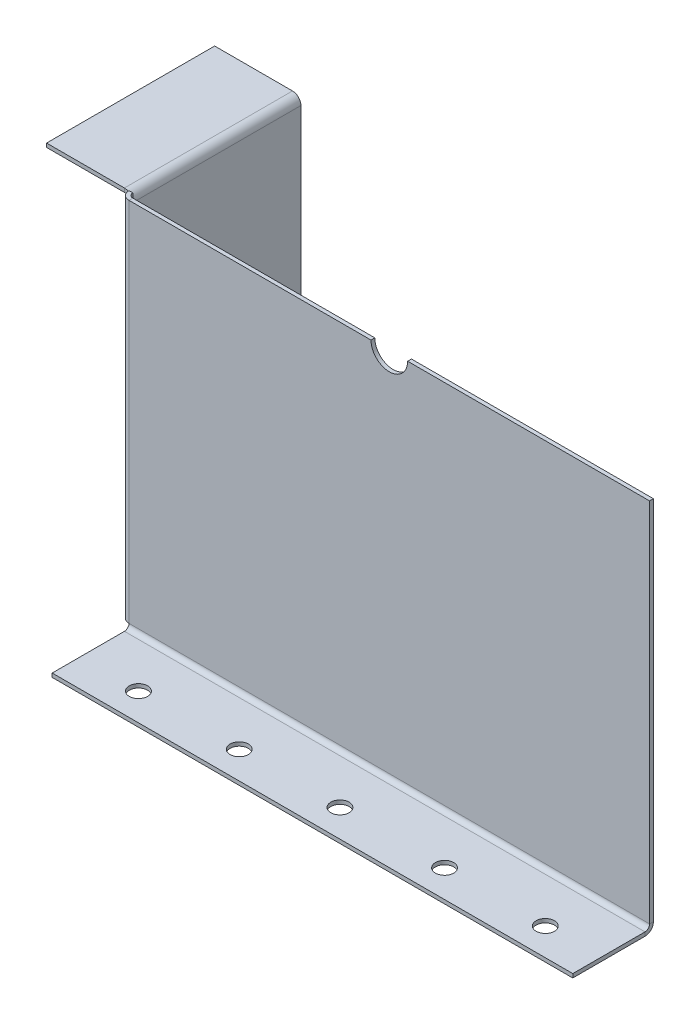
ISO-10303-21;
HEADER;
FILE_DESCRIPTION(('STEP AP214'),'2;1');
FILE_NAME('part.step','',(''),(''),'','','');
FILE_SCHEMA(('AUTOMOTIVE_DESIGN { 1 0 10303 214 1 1 1 1 }'));
ENDSEC;
DATA;
#1=APPLICATION_CONTEXT('core data for automotive mechanical design processes');
#2=APPLICATION_PROTOCOL_DEFINITION('international standard','automotive_design',2000,#1);
#3=PRODUCT_CONTEXT('',#1,'mechanical');
#4=PRODUCT('Part','Part','',(#3));
#5=PRODUCT_RELATED_PRODUCT_CATEGORY('part','',(#4));
#6=PRODUCT_DEFINITION_FORMATION('','',#4);
#7=PRODUCT_DEFINITION_CONTEXT('part definition',#1,'design');
#8=PRODUCT_DEFINITION('design','',#6,#7);
#9=PRODUCT_DEFINITION_SHAPE('','',#8);
#10=(LENGTH_UNIT() NAMED_UNIT(*) SI_UNIT(.MILLI.,.METRE.));
#11=(NAMED_UNIT(*) PLANE_ANGLE_UNIT() SI_UNIT($,.RADIAN.));
#12=(NAMED_UNIT(*) SI_UNIT($,.STERADIAN.) SOLID_ANGLE_UNIT());
#13=UNCERTAINTY_MEASURE_WITH_UNIT(LENGTH_MEASURE(1.E-05),#10,'distance_accuracy_value','');
#14=(GEOMETRIC_REPRESENTATION_CONTEXT(3) GLOBAL_UNCERTAINTY_ASSIGNED_CONTEXT((#13)) GLOBAL_UNIT_ASSIGNED_CONTEXT((#10,
#11,#12)) REPRESENTATION_CONTEXT('',''));
#15=CARTESIAN_POINT('',(0.,0.,0.));
#16=DIRECTION('',(0.,0.,1.));
#17=DIRECTION('',(1.,0.,0.));
#18=AXIS2_PLACEMENT_3D('',#15,#16,#17);
#19=CARTESIAN_POINT('',(-5.83183999999996,248.16816,-5.83183999999998));
#20=DIRECTION('',(0.,0.,-1.));
#21=DIRECTION('',(-1.,0.,0.));
#22=AXIS2_PLACEMENT_3D('',#19,#20,#21);
#23=PLANE('',#22);
#24=DIRECTION('',(0.,1.,0.));
#25=VECTOR('',#24,1.);
#26=CARTESIAN_POINT('',(-3.175,0.,-5.83183999999999));
#27=LINE('',#26,#25);
#28=CARTESIAN_POINT('',(-3.17499999999996,248.16816,-5.83183999999999));
#29=VERTEX_POINT('',#28);
#30=CARTESIAN_POINT('',(-3.17499999999998,254.,-5.83183999999999));
#31=VERTEX_POINT('',#30);
#32=EDGE_CURVE('E307',#29,#31,#27,.T.);
#33=ORIENTED_EDGE('',*,*,#32,.F.);
#34=CARTESIAN_POINT('',(-9.00683999999997,248.16816,-5.83183999999996));
#35=DIRECTION('',(0.,0.,-1.));
#36=DIRECTION('',(-1.,0.,0.));
#37=AXIS2_PLACEMENT_3D('',#34,#35,#36);
#38=CIRCLE('',#37,5.83184000000001);
#39=CARTESIAN_POINT('',(-5.83184,253.059962611063,-5.83183999999998));
#40=VERTEX_POINT('',#39);
#41=EDGE_CURVE('E267',#29,#40,#38,.F.);
#42=ORIENTED_EDGE('',*,*,#41,.T.);
#43=DIRECTION('',(0.,1.,0.));
#44=VECTOR('',#43,1.);
#45=CARTESIAN_POINT('',(-5.83184,0.,-5.83183999999998));
#46=LINE('',#45,#44);
#47=CARTESIAN_POINT('',(-5.83184,254.,-5.83183999999998));
#48=VERTEX_POINT('',#47);
#49=EDGE_CURVE('E296',#48,#40,#46,.F.);
#50=ORIENTED_EDGE('',*,*,#49,.F.);
#51=DIRECTION('',(1.,0.,0.));
#52=VECTOR('',#51,1.);
#53=CARTESIAN_POINT('',(-3.175,254.,-5.83183999999999));
#54=LINE('',#53,#52);
#55=EDGE_CURVE('E301',#31,#48,#54,.F.);
#56=ORIENTED_EDGE('',*,*,#55,.F.);
#57=EDGE_LOOP('',(#33,#42,#50,#56));
#58=FACE_BOUND('',#57,.T.);
#59=ADVANCED_FACE('F83',(#58),#23,.T.);
#60=CARTESIAN_POINT('',(-5.83183999999998,0.,0.));
#61=DIRECTION('',(1.,0.,0.));
#62=DIRECTION('',(0.,0.,-1.));
#63=AXIS2_PLACEMENT_3D('',#60,#61,#62);
#64=PLANE('',#63);
#65=CARTESIAN_POINT('',(-5.8318400000001,43.3241595873145,-35.989590500655));
#66=DIRECTION('',(-1.,0.,0.));
#67=DIRECTION('',(0.,0.,1.));
#68=AXIS2_PLACEMENT_3D('',#65,#66,#67);
#69=CIRCLE('',#68,6.35000000000002);
#70=CARTESIAN_POINT('',(-5.83184000000008,43.3241595873145,-29.639590500655));
#71=VERTEX_POINT('',#70);
#72=EDGE_CURVE('E261',#71,#71,#69,.T.);
#73=ORIENTED_EDGE('',*,*,#72,.F.);
#74=EDGE_LOOP('',(#73));
#75=FACE_BOUND('',#74,.T.);
#76=CARTESIAN_POINT('',(-5.8318400000003,45.9666651247975,-92.1249284860486));
#77=DIRECTION('',(-1.,0.,0.));
#78=DIRECTION('',(0.,0.,1.));
#79=AXIS2_PLACEMENT_3D('',#76,#77,#78);
#80=CIRCLE('',#79,6.35000000000002);
#81=CARTESIAN_POINT('',(-5.83184000000028,45.9666651247975,-85.7749284860486));
#82=VERTEX_POINT('',#81);
#83=EDGE_CURVE('E907',#82,#82,#80,.T.);
#84=ORIENTED_EDGE('',*,*,#83,.F.);
#85=EDGE_LOOP('',(#84));
#86=FACE_BOUND('',#85,.T.);
#87=DIRECTION('',(0.,0.,-1.));
#88=VECTOR('',#87,1.);
#89=CARTESIAN_POINT('',(-5.83184000000041,248.16816,-122.35434));
#90=LINE('',#89,#88);
#91=CARTESIAN_POINT('',(-5.83184000000041,248.16816,-122.35434));
#92=VERTEX_POINT('',#91);
#93=CARTESIAN_POINT('',(-5.83184,248.16816,-5.83183999999998));
#94=VERTEX_POINT('',#93);
#95=EDGE_CURVE('E274',#92,#94,#90,.F.);
#96=ORIENTED_EDGE('',*,*,#95,.F.);
#97=DIRECTION('',(0.,-1.,0.));
#98=VECTOR('',#97,1.);
#99=CARTESIAN_POINT('',(-5.83184000000041,0.,-122.35434));
#100=LINE('',#99,#98);
#101=CARTESIAN_POINT('',(-5.83184000000041,0.,-122.35434));
#102=VERTEX_POINT('',#101);
#103=EDGE_CURVE('E289',#92,#102,#100,.T.);
#104=ORIENTED_EDGE('',*,*,#103,.T.);
#105=DIRECTION('',(0.,0.,1.));
#106=VECTOR('',#105,1.);
#107=CARTESIAN_POINT('',(-5.83183999999998,0.,0.));
#108=LINE('',#107,#106);
#109=CARTESIAN_POINT('',(-5.83184,0.,-5.83183999999998));
#110=VERTEX_POINT('',#109);
#111=EDGE_CURVE('E286',#102,#110,#108,.T.);
#112=ORIENTED_EDGE('',*,*,#111,.T.);
#113=EDGE_CURVE('E300',#94,#110,#46,.F.);
#114=ORIENTED_EDGE('',*,*,#113,.F.);
#115=EDGE_LOOP('',(#96,#104,#112,#114));
#116=FACE_BOUND('',#115,.T.);
#117=ADVANCED_FACE('F506',(#75,#86,#116),#64,.F.);
#118=CARTESIAN_POINT('',(-3.17499999999998,0.,0.));
#119=DIRECTION('',(1.,0.,0.));
#120=DIRECTION('',(0.,0.,-1.));
#121=AXIS2_PLACEMENT_3D('',#118,#119,#120);
#122=PLANE('',#121);
#123=CARTESIAN_POINT('',(-3.17500000000009,43.3241595873145,-35.989590500655));
#124=DIRECTION('',(1.,0.,0.));
#125=DIRECTION('',(0.,0.,-1.));
#126=AXIS2_PLACEMENT_3D('',#123,#124,#125);
#127=CIRCLE('',#126,6.35000000000002);
#128=CARTESIAN_POINT('',(-3.17500000000012,43.3241595873145,-42.3395905006551));
#129=VERTEX_POINT('',#128);
#130=EDGE_CURVE('E903',#129,#129,#127,.F.);
#131=ORIENTED_EDGE('',*,*,#130,.T.);
#132=EDGE_LOOP('',(#131));
#133=FACE_BOUND('',#132,.T.);
#134=CARTESIAN_POINT('',(-3.17500000000032,45.9666651247975,-92.1249284860486));
#135=DIRECTION('',(1.,0.,0.));
#136=DIRECTION('',(0.,0.,-1.));
#137=AXIS2_PLACEMENT_3D('',#134,#135,#136);
#138=CIRCLE('',#137,6.35000000000002);
#139=CARTESIAN_POINT('',(-3.17500000000034,45.9666651247975,-98.4749284860487));
#140=VERTEX_POINT('',#139);
#141=EDGE_CURVE('E912',#140,#140,#138,.F.);
#142=ORIENTED_EDGE('',*,*,#141,.T.);
#143=EDGE_LOOP('',(#142));
#144=FACE_BOUND('',#143,.T.);
#145=DIRECTION('',(0.,1.,0.));
#146=VECTOR('',#145,1.);
#147=CARTESIAN_POINT('',(-3.17500000000041,0.,-122.35434));
#148=LINE('',#147,#146);
#149=CARTESIAN_POINT('',(-3.17500000000041,248.16816,-122.35434));
#150=VERTEX_POINT('',#149);
#151=CARTESIAN_POINT('',(-3.17500000000041,0.,-122.35434));
#152=VERTEX_POINT('',#151);
#153=EDGE_CURVE('E294',#150,#152,#148,.F.);
#154=ORIENTED_EDGE('',*,*,#153,.F.);
#155=DIRECTION('',(0.,0.,-1.));
#156=VECTOR('',#155,1.);
#157=CARTESIAN_POINT('',(-3.17500000000041,248.16816,-122.35434));
#158=LINE('',#157,#156);
#159=EDGE_CURVE('E262',#150,#29,#158,.F.);
#160=ORIENTED_EDGE('',*,*,#159,.T.);
#161=CARTESIAN_POINT('',(-3.175,0.,-5.83183999999999));
#162=VERTEX_POINT('',#161);
#163=EDGE_CURVE('E304',#162,#29,#27,.T.);
#164=ORIENTED_EDGE('',*,*,#163,.F.);
#165=DIRECTION('',(0.,0.,-1.));
#166=VECTOR('',#165,1.);
#167=CARTESIAN_POINT('',(-3.17499999999999,0.,-2.65684));
#168=LINE('',#167,#166);
#169=EDGE_CURVE('E291',#152,#162,#168,.F.);
#170=ORIENTED_EDGE('',*,*,#169,.F.);
#171=EDGE_LOOP('',(#154,#160,#164,#170));
#172=FACE_BOUND('',#171,.T.);
#173=ADVANCED_FACE('F512',(#133,#144,#172),#122,.T.);
#174=CARTESIAN_POINT('',(-5.83184000000041,0.,-122.35434));
#175=DIRECTION('',(0.,0.,1.));
#176=DIRECTION('',(1.,0.,0.));
#177=AXIS2_PLACEMENT_3D('',#174,#175,#176);
#178=PLANE('',#177);
#179=DIRECTION('',(1.,0.,0.));
#180=VECTOR('',#179,1.);
#181=CARTESIAN_POINT('',(-5.83184000000041,248.16816,-122.35434));
#182=LINE('',#181,#180);
#183=EDGE_CURVE('E270',#92,#150,#182,.T.);
#184=ORIENTED_EDGE('',*,*,#183,.T.);
#185=ORIENTED_EDGE('',*,*,#153,.T.);
#186=DIRECTION('',(1.,0.,0.));
#187=VECTOR('',#186,1.);
#188=CARTESIAN_POINT('',(-5.83184000000041,0.,-122.35434));
#189=LINE('',#188,#187);
#190=EDGE_CURVE('E282',#102,#152,#189,.T.);
#191=ORIENTED_EDGE('',*,*,#190,.F.);
#192=ORIENTED_EDGE('',*,*,#103,.F.);
#193=EDGE_LOOP('',(#184,#185,#191,#192));
#194=FACE_BOUND('',#193,.T.);
#195=ADVANCED_FACE('F522',(#194),#178,.F.);
#196=CARTESIAN_POINT('',(0.,-5.83184000000003,-3.89895559401467));
#197=DIRECTION('',(-1.,0.,0.));
#198=DIRECTION('',(0.,1.,0.));
#199=AXIS2_PLACEMENT_3D('',#196,#197,#198);
#200=PLANE('',#199);
#201=DIRECTION('',(0.,0.,1.));
#202=VECTOR('',#201,1.);
#203=CARTESIAN_POINT('',(0.,-3.17500000000003,-3.89895559401468));
#204=LINE('',#203,#202);
#205=CARTESIAN_POINT('',(0.,-3.175,3.175));
#206=VERTEX_POINT('',#205);
#207=CARTESIAN_POINT('',(0.,-3.17499999999983,53.2510444059853));
#208=VERTEX_POINT('',#207);
#209=EDGE_CURVE('E432',#206,#208,#204,.T.);
#210=ORIENTED_EDGE('',*,*,#209,.F.);
#211=DIRECTION('',(0.,-1.,0.));
#212=VECTOR('',#211,1.);
#213=CARTESIAN_POINT('',(0.,-5.83184000000005,3.175));
#214=LINE('',#213,#212);
#215=CARTESIAN_POINT('',(0.,-5.83184,3.17500000000002));
#216=VERTEX_POINT('',#215);
#217=EDGE_CURVE('E427',#206,#216,#214,.T.);
#218=ORIENTED_EDGE('',*,*,#217,.T.);
#219=DIRECTION('',(0.,0.,1.));
#220=VECTOR('',#219,1.);
#221=CARTESIAN_POINT('',(0.,-5.83184000000003,-3.89895559401467));
#222=LINE('',#221,#220);
#223=CARTESIAN_POINT('',(0.,-5.83183999999983,53.2510444059853));
#224=VERTEX_POINT('',#223);
#225=EDGE_CURVE('E87',#216,#224,#222,.T.);
#226=ORIENTED_EDGE('',*,*,#225,.T.);
#227=DIRECTION('',(0.,1.,0.));
#228=VECTOR('',#227,1.);
#229=CARTESIAN_POINT('',(0.,-5.83183999999983,53.2510444059853));
#230=LINE('',#229,#228);
#231=EDGE_CURVE('E422',#224,#208,#230,.T.);
#232=ORIENTED_EDGE('',*,*,#231,.T.);
#233=EDGE_LOOP('',(#210,#218,#226,#232));
#234=FACE_BOUND('',#233,.T.);
#235=ADVANCED_FACE('F436',(#234),#200,.T.);
#236=CARTESIAN_POINT('',(360.91368,-5.83184000000003,-3.89895559401467));
#237=DIRECTION('',(1.,0.,0.));
#238=DIRECTION('',(0.,-1.,0.));
#239=AXIS2_PLACEMENT_3D('',#236,#237,#238);
#240=PLANE('',#239);
#241=DIRECTION('',(0.,0.,-1.));
#242=VECTOR('',#241,1.);
#243=CARTESIAN_POINT('',(360.91368,-5.83184000000003,-3.89895559401467));
#244=LINE('',#243,#242);
#245=CARTESIAN_POINT('',(360.91368,-5.83183999999983,53.2510444059853));
#246=VERTEX_POINT('',#245);
#247=CARTESIAN_POINT('',(360.91368,-5.83184,3.17500000000002));
#248=VERTEX_POINT('',#247);
#249=EDGE_CURVE('E416',#246,#248,#244,.T.);
#250=ORIENTED_EDGE('',*,*,#249,.T.);
#251=DIRECTION('',(0.,1.,0.));
#252=VECTOR('',#251,1.);
#253=CARTESIAN_POINT('',(360.91368,-5.83184000000005,3.175));
#254=LINE('',#253,#252);
#255=CARTESIAN_POINT('',(360.91368,-3.175,3.175));
#256=VERTEX_POINT('',#255);
#257=EDGE_CURVE('E13',#248,#256,#254,.T.);
#258=ORIENTED_EDGE('',*,*,#257,.T.);
#259=DIRECTION('',(0.,0.,-1.));
#260=VECTOR('',#259,1.);
#261=CARTESIAN_POINT('',(360.91368,-3.17500000000003,-3.89895559401468));
#262=LINE('',#261,#260);
#263=CARTESIAN_POINT('',(360.91368,-3.17499999999983,53.2510444059853));
#264=VERTEX_POINT('',#263);
#265=EDGE_CURVE('E108',#264,#256,#262,.T.);
#266=ORIENTED_EDGE('',*,*,#265,.F.);
#267=DIRECTION('',(0.,1.,0.));
#268=VECTOR('',#267,1.);
#269=CARTESIAN_POINT('',(360.91368,-5.83183999999983,53.2510444059853));
#270=LINE('',#269,#268);
#271=EDGE_CURVE('E418',#246,#264,#270,.T.);
#272=ORIENTED_EDGE('',*,*,#271,.F.);
#273=EDGE_LOOP('',(#250,#258,#266,#272));
#274=FACE_BOUND('',#273,.T.);
#275=ADVANCED_FACE('F85',(#274),#240,.T.);
#276=CARTESIAN_POINT('',(180.45684,-3.17500000000092,-257.898955594015));
#277=DIRECTION('',(0.,1.,0.));
#278=DIRECTION('',(1.,0.,0.));
#279=AXIS2_PLACEMENT_3D('',#276,#277,#278);
#280=PLANE('',#279);
#281=CARTESIAN_POINT('',(322.81368,-3.1749999999999,34.2010444059853));
#282=DIRECTION('',(0.,1.,0.));
#283=DIRECTION('',(0.,0.,1.));
#284=AXIS2_PLACEMENT_3D('',#281,#282,#283);
#285=CIRCLE('',#284,6.35);
#286=CARTESIAN_POINT('',(322.81368,-3.17499999999987,40.5510444059853));
#287=VERTEX_POINT('',#286);
#288=EDGE_CURVE('E322',#287,#287,#285,.T.);
#289=ORIENTED_EDGE('',*,*,#288,.F.);
#290=EDGE_LOOP('',(#289));
#291=FACE_BOUND('',#290,.T.);
#292=CARTESIAN_POINT('',(180.45684,-3.1749999999999,34.2010444059853));
#293=DIRECTION('',(0.,1.,0.));
#294=DIRECTION('',(0.,0.,1.));
#295=AXIS2_PLACEMENT_3D('',#292,#293,#294);
#296=CIRCLE('',#295,6.35);
#297=CARTESIAN_POINT('',(180.45684,-3.17499999999987,40.5510444059853));
#298=VERTEX_POINT('',#297);
#299=EDGE_CURVE('E313',#298,#298,#296,.T.);
#300=ORIENTED_EDGE('',*,*,#299,.F.);
#301=EDGE_LOOP('',(#300));
#302=FACE_BOUND('',#301,.T.);
#303=CARTESIAN_POINT('',(110.60684,-3.1749999999999,34.2010444059853));
#304=DIRECTION('',(0.,1.,0.));
#305=DIRECTION('',(0.,0.,1.));
#306=AXIS2_PLACEMENT_3D('',#303,#304,#305);
#307=CIRCLE('',#306,6.35);
#308=CARTESIAN_POINT('',(110.60684,-3.17499999999987,40.5510444059853));
#309=VERTEX_POINT('',#308);
#310=EDGE_CURVE('E330',#309,#309,#307,.T.);
#311=ORIENTED_EDGE('',*,*,#310,.F.);
#312=EDGE_LOOP('',(#311));
#313=FACE_BOUND('',#312,.T.);
#314=CARTESIAN_POINT('',(40.75684,-3.1749999999999,34.2010444059853));
#315=DIRECTION('',(0.,1.,0.));
#316=DIRECTION('',(0.,0.,1.));
#317=AXIS2_PLACEMENT_3D('',#314,#315,#316);
#318=CIRCLE('',#317,6.35);
#319=CARTESIAN_POINT('',(40.75684,-3.17499999999987,40.5510444059853));
#320=VERTEX_POINT('',#319);
#321=EDGE_CURVE('E337',#320,#320,#318,.T.);
#322=ORIENTED_EDGE('',*,*,#321,.F.);
#323=EDGE_LOOP('',(#322));
#324=FACE_BOUND('',#323,.T.);
#325=CARTESIAN_POINT('',(252.96368,-3.1749999999999,34.2010444059853));
#326=DIRECTION('',(0.,1.,0.));
#327=DIRECTION('',(0.,0.,1.));
#328=AXIS2_PLACEMENT_3D('',#325,#326,#327);
#329=CIRCLE('',#328,6.34999999999994);
#330=CARTESIAN_POINT('',(252.96368,-3.17499999999987,40.5510444059853));
#331=VERTEX_POINT('',#330);
#332=EDGE_CURVE('E342',#331,#331,#329,.T.);
#333=ORIENTED_EDGE('',*,*,#332,.F.);
#334=EDGE_LOOP('',(#333));
#335=FACE_BOUND('',#334,.T.);
#336=ORIENTED_EDGE('',*,*,#265,.T.);
#337=DIRECTION('',(-1.,0.,0.));
#338=VECTOR('',#337,1.);
#339=CARTESIAN_POINT('',(180.45684,-3.175,3.17500000000001));
#340=LINE('',#339,#338);
#341=EDGE_CURVE('E92',#256,#206,#340,.T.);
#342=ORIENTED_EDGE('',*,*,#341,.T.);
#343=ORIENTED_EDGE('',*,*,#209,.T.);
#344=DIRECTION('',(1.,0.,0.));
#345=VECTOR('',#344,1.);
#346=CARTESIAN_POINT('',(0.,-3.17499999999983,53.2510444059853));
#347=LINE('',#346,#345);
#348=EDGE_CURVE('E367',#208,#264,#347,.T.);
#349=ORIENTED_EDGE('',*,*,#348,.T.);
#350=EDGE_LOOP('',(#336,#342,#343,#349));
#351=FACE_BOUND('',#350,.T.);
#352=ADVANCED_FACE('F494',(#291,#302,#313,#324,#335,#351),#280,.T.);
#353=CARTESIAN_POINT('',(0.,-5.83183999999983,53.2510444059853));
#354=DIRECTION('',(0.,0.,1.));
#355=DIRECTION('',(0.,-1.,0.));
#356=AXIS2_PLACEMENT_3D('',#353,#354,#355);
#357=PLANE('',#356);
#358=ORIENTED_EDGE('',*,*,#348,.F.);
#359=ORIENTED_EDGE('',*,*,#231,.F.);
#360=DIRECTION('',(1.,0.,0.));
#361=VECTOR('',#360,1.);
#362=CARTESIAN_POINT('',(0.,-5.83183999999983,53.2510444059853));
#363=LINE('',#362,#361);
#364=EDGE_CURVE('E413',#224,#246,#363,.T.);
#365=ORIENTED_EDGE('',*,*,#364,.T.);
#366=ORIENTED_EDGE('',*,*,#271,.T.);
#367=EDGE_LOOP('',(#358,#359,#365,#366));
#368=FACE_BOUND('',#367,.T.);
#369=ADVANCED_FACE('F442',(#368),#357,.T.);
#370=CARTESIAN_POINT('',(180.45684,-5.83184000000091,-257.898955594015));
#371=DIRECTION('',(0.,1.,0.));
#372=DIRECTION('',(1.,0.,0.));
#373=AXIS2_PLACEMENT_3D('',#370,#371,#372);
#374=PLANE('',#373);
#375=CARTESIAN_POINT('',(322.81368,-5.83183999999989,34.2010444059853));
#376=DIRECTION('',(0.,1.,0.));
#377=DIRECTION('',(0.,0.,1.));
#378=AXIS2_PLACEMENT_3D('',#375,#376,#377);
#379=CIRCLE('',#378,6.35);
#380=CARTESIAN_POINT('',(322.81368,-5.83183999999987,40.5510444059853));
#381=VERTEX_POINT('',#380);
#382=EDGE_CURVE('E325',#381,#381,#379,.F.);
#383=ORIENTED_EDGE('',*,*,#382,.F.);
#384=EDGE_LOOP('',(#383));
#385=FACE_BOUND('',#384,.T.);
#386=CARTESIAN_POINT('',(180.45684,-5.83183999999989,34.2010444059853));
#387=DIRECTION('',(0.,1.,0.));
#388=DIRECTION('',(0.,0.,1.));
#389=AXIS2_PLACEMENT_3D('',#386,#387,#388);
#390=CIRCLE('',#389,6.35);
#391=CARTESIAN_POINT('',(180.45684,-5.83183999999987,40.5510444059853));
#392=VERTEX_POINT('',#391);
#393=EDGE_CURVE('E334',#392,#392,#390,.F.);
#394=ORIENTED_EDGE('',*,*,#393,.F.);
#395=EDGE_LOOP('',(#394));
#396=FACE_BOUND('',#395,.T.);
#397=CARTESIAN_POINT('',(110.60684,-5.83183999999989,34.2010444059853));
#398=DIRECTION('',(0.,1.,0.));
#399=DIRECTION('',(0.,0.,1.));
#400=AXIS2_PLACEMENT_3D('',#397,#398,#399);
#401=CIRCLE('',#400,6.35);
#402=CARTESIAN_POINT('',(110.60684,-5.83183999999987,40.5510444059853));
#403=VERTEX_POINT('',#402);
#404=EDGE_CURVE('E333',#403,#403,#401,.F.);
#405=ORIENTED_EDGE('',*,*,#404,.F.);
#406=EDGE_LOOP('',(#405));
#407=FACE_BOUND('',#406,.T.);
#408=CARTESIAN_POINT('',(40.75684,-5.83183999999989,34.2010444059853));
#409=DIRECTION('',(0.,1.,0.));
#410=DIRECTION('',(0.,0.,1.));
#411=AXIS2_PLACEMENT_3D('',#408,#409,#410);
#412=CIRCLE('',#411,6.35);
#413=CARTESIAN_POINT('',(40.75684,-5.83183999999987,40.5510444059853));
#414=VERTEX_POINT('',#413);
#415=EDGE_CURVE('E345',#414,#414,#412,.F.);
#416=ORIENTED_EDGE('',*,*,#415,.F.);
#417=EDGE_LOOP('',(#416));
#418=FACE_BOUND('',#417,.T.);
#419=CARTESIAN_POINT('',(252.96368,-5.83183999999989,34.2010444059853));
#420=DIRECTION('',(0.,1.,0.));
#421=DIRECTION('',(0.,0.,1.));
#422=AXIS2_PLACEMENT_3D('',#419,#420,#421);
#423=CIRCLE('',#422,6.34999999999994);
#424=CARTESIAN_POINT('',(252.96368,-5.83183999999987,40.5510444059853));
#425=VERTEX_POINT('',#424);
#426=EDGE_CURVE('E326',#425,#425,#423,.F.);
#427=ORIENTED_EDGE('',*,*,#426,.F.);
#428=EDGE_LOOP('',(#427));
#429=FACE_BOUND('',#428,.T.);
#430=DIRECTION('',(-1.,0.,0.));
#431=VECTOR('',#430,1.);
#432=CARTESIAN_POINT('',(180.45684,-5.83184,3.17500000000002));
#433=LINE('',#432,#431);
#434=EDGE_CURVE('E421',#248,#216,#433,.T.);
#435=ORIENTED_EDGE('',*,*,#434,.F.);
#436=ORIENTED_EDGE('',*,*,#249,.F.);
#437=ORIENTED_EDGE('',*,*,#364,.F.);
#438=ORIENTED_EDGE('',*,*,#225,.F.);
#439=EDGE_LOOP('',(#435,#436,#437,#438));
#440=FACE_BOUND('',#439,.T.);
#441=ADVANCED_FACE('F444',(#385,#396,#407,#418,#429,#440),#374,.F.);
#442=CARTESIAN_POINT('',(193.15684,254.,-2.65684));
#443=DIRECTION('',(0.,1.,0.));
#444=DIRECTION('',(-1.,0.,0.));
#445=AXIS2_PLACEMENT_3D('',#442,#443,#444);
#446=PLANE('',#445);
#447=DIRECTION('',(-1.,0.,0.));
#448=VECTOR('',#447,1.);
#449=CARTESIAN_POINT('',(193.15684,254.,0.));
#450=LINE('',#449,#448);
#451=CARTESIAN_POINT('',(360.91368,254.,0.));
#452=VERTEX_POINT('',#451);
#453=CARTESIAN_POINT('',(193.15684,254.,0.));
#454=VERTEX_POINT('',#453);
#455=EDGE_CURVE('E379',#452,#454,#450,.T.);
#456=ORIENTED_EDGE('',*,*,#455,.F.);
#457=DIRECTION('',(0.,0.,1.));
#458=VECTOR('',#457,1.);
#459=CARTESIAN_POINT('',(360.91368,254.,-2.65684));
#460=LINE('',#459,#458);
#461=CARTESIAN_POINT('',(360.91368,254.,-2.65684));
#462=VERTEX_POINT('',#461);
#463=EDGE_CURVE('E364',#462,#452,#460,.T.);
#464=ORIENTED_EDGE('',*,*,#463,.F.);
#465=DIRECTION('',(-1.,0.,0.));
#466=VECTOR('',#465,1.);
#467=CARTESIAN_POINT('',(193.15684,254.,-2.65684));
#468=LINE('',#467,#466);
#469=CARTESIAN_POINT('',(193.15684,254.,-2.65684));
#470=VERTEX_POINT('',#469);
#471=EDGE_CURVE('E402',#462,#470,#468,.T.);
#472=ORIENTED_EDGE('',*,*,#471,.T.);
#473=DIRECTION('',(0.,0.,1.));
#474=VECTOR('',#473,1.);
#475=CARTESIAN_POINT('',(193.15684,254.,-2.65684));
#476=LINE('',#475,#474);
#477=EDGE_CURVE('E400',#470,#454,#476,.T.);
#478=ORIENTED_EDGE('',*,*,#477,.T.);
#479=EDGE_LOOP('',(#456,#464,#472,#478));
#480=FACE_BOUND('',#479,.T.);
#481=ADVANCED_FACE('F488',(#480),#446,.T.);
#482=CARTESIAN_POINT('',(180.45684,254.,-2.65684));
#483=DIRECTION('',(0.,0.,1.));
#484=DIRECTION('',(1.,0.,0.));
#485=AXIS2_PLACEMENT_3D('',#482,#483,#484);
#486=CYLINDRICAL_SURFACE('',#485,12.7);
#487=CARTESIAN_POINT('',(180.45684,254.,0.));
#488=DIRECTION('',(0.,0.,-1.));
#489=DIRECTION('',(1.,0.,0.));
#490=AXIS2_PLACEMENT_3D('',#487,#488,#489);
#491=CIRCLE('',#490,12.7);
#492=CARTESIAN_POINT('',(167.75684,254.,0.));
#493=VERTEX_POINT('',#492);
#494=EDGE_CURVE('E376',#454,#493,#491,.T.);
#495=ORIENTED_EDGE('',*,*,#494,.F.);
#496=ORIENTED_EDGE('',*,*,#477,.F.);
#497=CARTESIAN_POINT('',(180.45684,254.,-2.65684));
#498=DIRECTION('',(0.,0.,-1.));
#499=DIRECTION('',(1.,0.,0.));
#500=AXIS2_PLACEMENT_3D('',#497,#498,#499);
#501=CIRCLE('',#500,12.7);
#502=CARTESIAN_POINT('',(167.75684,254.,-2.65684));
#503=VERTEX_POINT('',#502);
#504=EDGE_CURVE('E397',#470,#503,#501,.T.);
#505=ORIENTED_EDGE('',*,*,#504,.T.);
#506=DIRECTION('',(0.,0.,1.));
#507=VECTOR('',#506,1.);
#508=CARTESIAN_POINT('',(167.75684,254.,-2.65684));
#509=LINE('',#508,#507);
#510=EDGE_CURVE('E395',#503,#493,#509,.T.);
#511=ORIENTED_EDGE('',*,*,#510,.T.);
#512=EDGE_LOOP('',(#495,#496,#505,#511));
#513=FACE_BOUND('',#512,.T.);
#514=ADVANCED_FACE('F485',(#513),#486,.F.);
#515=CARTESIAN_POINT('',(0.,254.,-2.65684));
#516=DIRECTION('',(0.,1.,0.));
#517=DIRECTION('',(-1.,0.,0.));
#518=AXIS2_PLACEMENT_3D('',#515,#516,#517);
#519=PLANE('',#518);
#520=DIRECTION('',(-1.,0.,0.));
#521=VECTOR('',#520,1.);
#522=CARTESIAN_POINT('',(0.,254.,0.));
#523=LINE('',#522,#521);
#524=CARTESIAN_POINT('',(0.,254.,0.));
#525=VERTEX_POINT('',#524);
#526=EDGE_CURVE('E373',#493,#525,#523,.T.);
#527=ORIENTED_EDGE('',*,*,#526,.F.);
#528=ORIENTED_EDGE('',*,*,#510,.F.);
#529=DIRECTION('',(-1.,0.,0.));
#530=VECTOR('',#529,1.);
#531=CARTESIAN_POINT('',(0.,254.,-2.65684));
#532=LINE('',#531,#530);
#533=CARTESIAN_POINT('',(0.,254.,-2.65684000000001));
#534=VERTEX_POINT('',#533);
#535=EDGE_CURVE('E392',#503,#534,#532,.T.);
#536=ORIENTED_EDGE('',*,*,#535,.T.);
#537=DIRECTION('',(0.,0.,1.));
#538=VECTOR('',#537,1.);
#539=CARTESIAN_POINT('',(0.,254.,-2.65684));
#540=LINE('',#539,#538);
#541=EDGE_CURVE('E389',#534,#525,#540,.T.);
#542=ORIENTED_EDGE('',*,*,#541,.T.);
#543=EDGE_LOOP('',(#527,#528,#536,#542));
#544=FACE_BOUND('',#543,.T.);
#545=ADVANCED_FACE('F481',(#544),#519,.T.);
#546=CARTESIAN_POINT('',(180.45684,254.,-2.65684));
#547=DIRECTION('',(0.,0.,1.));
#548=DIRECTION('',(1.,0.,0.));
#549=AXIS2_PLACEMENT_3D('',#546,#547,#548);
#550=PLANE('',#549);
#551=DIRECTION('',(0.,1.,0.));
#552=VECTOR('',#551,1.);
#553=CARTESIAN_POINT('',(360.91368,0.,-2.65684));
#554=LINE('',#553,#552);
#555=CARTESIAN_POINT('',(360.91368,0.,-2.65684));
#556=VERTEX_POINT('',#555);
#557=EDGE_CURVE('E368',#556,#462,#554,.T.);
#558=ORIENTED_EDGE('',*,*,#557,.F.);
#559=DIRECTION('',(-1.,0.,0.));
#560=VECTOR('',#559,1.);
#561=CARTESIAN_POINT('',(180.45684,0.,-2.65684));
#562=LINE('',#561,#560);
#563=CARTESIAN_POINT('',(0.,0.,-2.65684000000001));
#564=VERTEX_POINT('',#563);
#565=EDGE_CURVE('E386',#556,#564,#562,.T.);
#566=ORIENTED_EDGE('',*,*,#565,.T.);
#567=DIRECTION('',(0.,-1.,0.));
#568=VECTOR('',#567,1.);
#569=CARTESIAN_POINT('',(0.,0.,-2.65684));
#570=LINE('',#569,#568);
#571=EDGE_CURVE('E384',#534,#564,#570,.T.);
#572=ORIENTED_EDGE('',*,*,#571,.F.);
#573=ORIENTED_EDGE('',*,*,#535,.F.);
#574=ORIENTED_EDGE('',*,*,#504,.F.);
#575=ORIENTED_EDGE('',*,*,#471,.F.);
#576=EDGE_LOOP('',(#558,#566,#572,#573,#574,#575));
#577=FACE_BOUND('',#576,.T.);
#578=ADVANCED_FACE('F458',(#577),#550,.F.);
#579=CARTESIAN_POINT('',(180.45684,254.,0.));
#580=DIRECTION('',(0.,0.,1.));
#581=DIRECTION('',(1.,0.,0.));
#582=AXIS2_PLACEMENT_3D('',#579,#580,#581);
#583=PLANE('',#582);
#584=DIRECTION('',(-1.,0.,0.));
#585=VECTOR('',#584,1.);
#586=CARTESIAN_POINT('',(180.45684,0.,0.));
#587=LINE('',#586,#585);
#588=CARTESIAN_POINT('',(360.91368,0.,0.));
#589=VERTEX_POINT('',#588);
#590=CARTESIAN_POINT('',(0.,0.,0.));
#591=VERTEX_POINT('',#590);
#592=EDGE_CURVE('E408',#589,#591,#587,.T.);
#593=ORIENTED_EDGE('',*,*,#592,.F.);
#594=DIRECTION('',(0.,1.,0.));
#595=VECTOR('',#594,1.);
#596=CARTESIAN_POINT('',(360.91368,0.,0.));
#597=LINE('',#596,#595);
#598=EDGE_CURVE('E382',#589,#452,#597,.T.);
#599=ORIENTED_EDGE('',*,*,#598,.T.);
#600=ORIENTED_EDGE('',*,*,#455,.T.);
#601=ORIENTED_EDGE('',*,*,#494,.T.);
#602=ORIENTED_EDGE('',*,*,#526,.T.);
#603=DIRECTION('',(0.,-1.,0.));
#604=VECTOR('',#603,1.);
#605=CARTESIAN_POINT('',(0.,0.,0.));
#606=LINE('',#605,#604);
#607=EDGE_CURVE('E370',#525,#591,#606,.T.);
#608=ORIENTED_EDGE('',*,*,#607,.T.);
#609=EDGE_LOOP('',(#593,#599,#600,#601,#602,#608));
#610=FACE_BOUND('',#609,.T.);
#611=ADVANCED_FACE('F471',(#610),#583,.T.);
#612=CARTESIAN_POINT('',(360.91368,0.,-2.65684));
#613=DIRECTION('',(1.,0.,0.));
#614=DIRECTION('',(0.,0.,-1.));
#615=AXIS2_PLACEMENT_3D('',#612,#613,#614);
#616=PLANE('',#615);
#617=DIRECTION('',(0.,0.,1.));
#618=VECTOR('',#617,1.);
#619=CARTESIAN_POINT('',(360.91368,0.,-2.65684));
#620=LINE('',#619,#618);
#621=EDGE_CURVE('E359',#556,#589,#620,.T.);
#622=ORIENTED_EDGE('',*,*,#621,.F.);
#623=ORIENTED_EDGE('',*,*,#557,.T.);
#624=ORIENTED_EDGE('',*,*,#463,.T.);
#625=ORIENTED_EDGE('',*,*,#598,.F.);
#626=EDGE_LOOP('',(#622,#623,#624,#625));
#627=FACE_BOUND('',#626,.T.);
#628=ADVANCED_FACE('F491',(#627),#616,.T.);
#629=CARTESIAN_POINT('',(360.91368,0.,3.175));
#630=DIRECTION('',(1.,0.,0.));
#631=DIRECTION('',(0.,0.,-1.));
#632=AXIS2_PLACEMENT_3D('',#629,#630,#631);
#633=PLANE('',#632);
#634=ORIENTED_EDGE('',*,*,#621,.T.);
#635=CARTESIAN_POINT('',(360.91368,0.,3.175));
#636=DIRECTION('',(-1.,0.,0.));
#637=DIRECTION('',(0.,0.,1.));
#638=AXIS2_PLACEMENT_3D('',#635,#636,#637);
#639=CIRCLE('',#638,3.175);
#640=EDGE_CURVE('E329',#589,#256,#639,.T.);
#641=ORIENTED_EDGE('',*,*,#640,.T.);
#642=ORIENTED_EDGE('',*,*,#257,.F.);
#643=CARTESIAN_POINT('',(360.91368,0.,3.175));
#644=DIRECTION('',(-1.,0.,0.));
#645=DIRECTION('',(0.,0.,-1.));
#646=AXIS2_PLACEMENT_3D('',#643,#644,#645);
#647=CIRCLE('',#646,5.83184);
#648=EDGE_CURVE('E352',#556,#248,#647,.T.);
#649=ORIENTED_EDGE('',*,*,#648,.F.);
#650=EDGE_LOOP('',(#634,#641,#642,#649));
#651=FACE_BOUND('',#650,.T.);
#652=ADVANCED_FACE('F450',(#651),#633,.T.);
#653=CARTESIAN_POINT('',(0.,0.,3.175));
#654=DIRECTION('',(-1.,0.,0.));
#655=DIRECTION('',(0.,0.,1.));
#656=AXIS2_PLACEMENT_3D('',#653,#654,#655);
#657=PLANE('',#656);
#658=ORIENTED_EDGE('',*,*,#217,.F.);
#659=CARTESIAN_POINT('',(0.,0.,3.175));
#660=DIRECTION('',(-1.,0.,0.));
#661=DIRECTION('',(0.,0.,1.));
#662=AXIS2_PLACEMENT_3D('',#659,#660,#661);
#663=CIRCLE('',#662,3.175);
#664=EDGE_CURVE('E356',#206,#591,#663,.F.);
#665=ORIENTED_EDGE('',*,*,#664,.T.);
#666=DIRECTION('',(0.,0.,-1.));
#667=VECTOR('',#666,1.);
#668=CARTESIAN_POINT('',(0.,0.,-2.65684));
#669=LINE('',#668,#667);
#670=EDGE_CURVE('E405',#591,#564,#669,.T.);
#671=ORIENTED_EDGE('',*,*,#670,.T.);
#672=CARTESIAN_POINT('',(0.,0.,3.175));
#673=DIRECTION('',(1.,0.,0.));
#674=DIRECTION('',(0.,0.,1.));
#675=AXIS2_PLACEMENT_3D('',#672,#673,#674);
#676=CIRCLE('',#675,5.83184);
#677=EDGE_CURVE('E355',#216,#564,#676,.T.);
#678=ORIENTED_EDGE('',*,*,#677,.F.);
#679=EDGE_LOOP('',(#658,#665,#671,#678));
#680=FACE_BOUND('',#679,.T.);
#681=ADVANCED_FACE('F464',(#680),#657,.T.);
#682=CARTESIAN_POINT('',(541.449615630862,0.,3.175));
#683=DIRECTION('',(-1.,0.,0.));
#684=DIRECTION('',(0.,0.,1.));
#685=AXIS2_PLACEMENT_3D('',#682,#683,#684);
#686=CYLINDRICAL_SURFACE('',#685,5.83184);
#687=ORIENTED_EDGE('',*,*,#677,.T.);
#688=ORIENTED_EDGE('',*,*,#565,.F.);
#689=ORIENTED_EDGE('',*,*,#648,.T.);
#690=ORIENTED_EDGE('',*,*,#434,.T.);
#691=EDGE_LOOP('',(#687,#688,#689,#690));
#692=FACE_BOUND('',#691,.T.);
#693=ADVANCED_FACE('F454',(#692),#686,.T.);
#694=CARTESIAN_POINT('',(541.449615630862,0.,3.175));
#695=DIRECTION('',(-1.,0.,0.));
#696=DIRECTION('',(0.,0.,1.));
#697=AXIS2_PLACEMENT_3D('',#694,#695,#696);
#698=CYLINDRICAL_SURFACE('',#697,3.175);
#699=ORIENTED_EDGE('',*,*,#664,.F.);
#700=ORIENTED_EDGE('',*,*,#341,.F.);
#701=ORIENTED_EDGE('',*,*,#640,.F.);
#702=ORIENTED_EDGE('',*,*,#592,.T.);
#703=EDGE_LOOP('',(#699,#700,#701,#702));
#704=FACE_BOUND('',#703,.T.);
#705=ADVANCED_FACE('F493',(#704),#698,.F.);
#706=CARTESIAN_POINT('',(252.96368,-5.83284000000007,34.2010444059853));
#707=DIRECTION('',(0.,1.,0.));
#708=DIRECTION('',(0.,0.,1.));
#709=AXIS2_PLACEMENT_3D('',#706,#707,#708);
#710=CYLINDRICAL_SURFACE('',#709,6.34999999999994);
#711=ORIENTED_EDGE('',*,*,#332,.T.);
#712=EDGE_LOOP('',(#711));
#713=FACE_BOUND('',#712,.T.);
#714=ORIENTED_EDGE('',*,*,#426,.T.);
#715=EDGE_LOOP('',(#714));
#716=FACE_BOUND('',#715,.T.);
#717=ADVANCED_FACE('F555',(#713,#716),#710,.F.);
#718=CARTESIAN_POINT('',(40.75684,-5.83284000000007,34.2010444059853));
#719=DIRECTION('',(0.,1.,0.));
#720=DIRECTION('',(0.,0.,1.));
#721=AXIS2_PLACEMENT_3D('',#718,#719,#720);
#722=CYLINDRICAL_SURFACE('',#721,6.35);
#723=ORIENTED_EDGE('',*,*,#321,.T.);
#724=EDGE_LOOP('',(#723));
#725=FACE_BOUND('',#724,.T.);
#726=ORIENTED_EDGE('',*,*,#415,.T.);
#727=EDGE_LOOP('',(#726));
#728=FACE_BOUND('',#727,.T.);
#729=ADVANCED_FACE('F550',(#725,#728),#722,.F.);
#730=CARTESIAN_POINT('',(110.60684,-5.83284000000007,34.2010444059853));
#731=DIRECTION('',(0.,1.,0.));
#732=DIRECTION('',(0.,0.,1.));
#733=AXIS2_PLACEMENT_3D('',#730,#731,#732);
#734=CYLINDRICAL_SURFACE('',#733,6.35);
#735=ORIENTED_EDGE('',*,*,#310,.T.);
#736=EDGE_LOOP('',(#735));
#737=FACE_BOUND('',#736,.T.);
#738=ORIENTED_EDGE('',*,*,#404,.T.);
#739=EDGE_LOOP('',(#738));
#740=FACE_BOUND('',#739,.T.);
#741=ADVANCED_FACE('F547',(#737,#740),#734,.F.);
#742=CARTESIAN_POINT('',(180.45684,-5.83284000000007,34.2010444059853));
#743=DIRECTION('',(0.,1.,0.));
#744=DIRECTION('',(0.,0.,1.));
#745=AXIS2_PLACEMENT_3D('',#742,#743,#744);
#746=CYLINDRICAL_SURFACE('',#745,6.35);
#747=ORIENTED_EDGE('',*,*,#299,.T.);
#748=EDGE_LOOP('',(#747));
#749=FACE_BOUND('',#748,.T.);
#750=ORIENTED_EDGE('',*,*,#393,.T.);
#751=EDGE_LOOP('',(#750));
#752=FACE_BOUND('',#751,.T.);
#753=ADVANCED_FACE('F545',(#749,#752),#746,.F.);
#754=CARTESIAN_POINT('',(322.81368,-5.83284000000007,34.2010444059853));
#755=DIRECTION('',(0.,1.,0.));
#756=DIRECTION('',(0.,0.,1.));
#757=AXIS2_PLACEMENT_3D('',#754,#755,#756);
#758=CYLINDRICAL_SURFACE('',#757,6.35);
#759=ORIENTED_EDGE('',*,*,#288,.T.);
#760=EDGE_LOOP('',(#759));
#761=FACE_BOUND('',#760,.T.);
#762=ORIENTED_EDGE('',*,*,#382,.T.);
#763=EDGE_LOOP('',(#762));
#764=FACE_BOUND('',#763,.T.);
#765=ADVANCED_FACE('F540',(#761,#764),#758,.F.);
#766=CARTESIAN_POINT('',(0.,0.,-5.83184));
#767=DIRECTION('',(0.,-1.,0.));
#768=DIRECTION('',(1.,0.,0.));
#769=AXIS2_PLACEMENT_3D('',#766,#767,#768);
#770=PLANE('',#769);
#771=DIRECTION('',(1.,0.,0.));
#772=VECTOR('',#771,1.);
#773=CARTESIAN_POINT('',(-5.83184,0.,-5.83183999999998));
#774=LINE('',#773,#772);
#775=EDGE_CURVE('E281',#162,#110,#774,.F.);
#776=ORIENTED_EDGE('',*,*,#775,.F.);
#777=CARTESIAN_POINT('',(0.,0.,-5.83184));
#778=DIRECTION('',(0.,1.,0.));
#779=DIRECTION('',(-1.,0.,0.));
#780=AXIS2_PLACEMENT_3D('',#777,#778,#779);
#781=CIRCLE('',#780,3.17499999999999);
#782=EDGE_CURVE('E317',#564,#162,#781,.F.);
#783=ORIENTED_EDGE('',*,*,#782,.F.);
#784=ORIENTED_EDGE('',*,*,#670,.F.);
#785=CARTESIAN_POINT('',(0.,0.,-5.83184));
#786=DIRECTION('',(0.,1.,0.));
#787=DIRECTION('',(-1.,0.,0.));
#788=AXIS2_PLACEMENT_3D('',#785,#786,#787);
#789=CIRCLE('',#788,5.83183999999999);
#790=EDGE_CURVE('E310',#591,#110,#789,.F.);
#791=ORIENTED_EDGE('',*,*,#790,.T.);
#792=EDGE_LOOP('',(#776,#783,#784,#791));
#793=FACE_BOUND('',#792,.T.);
#794=ADVANCED_FACE('F468',(#793),#770,.T.);
#795=CARTESIAN_POINT('',(0.,254.,-5.83184));
#796=DIRECTION('',(0.,-1.,0.));
#797=DIRECTION('',(1.,0.,0.));
#798=AXIS2_PLACEMENT_3D('',#795,#796,#797);
#799=PLANE('',#798);
#800=CARTESIAN_POINT('',(0.,254.,-5.83184));
#801=DIRECTION('',(0.,1.,0.));
#802=DIRECTION('',(-1.,0.,0.));
#803=AXIS2_PLACEMENT_3D('',#800,#801,#802);
#804=CIRCLE('',#803,3.17499999999999);
#805=EDGE_CURVE('E285',#31,#534,#804,.T.);
#806=ORIENTED_EDGE('',*,*,#805,.F.);
#807=ORIENTED_EDGE('',*,*,#55,.T.);
#808=CARTESIAN_POINT('',(0.,254.,-5.83184));
#809=DIRECTION('',(0.,1.,0.));
#810=DIRECTION('',(-1.,0.,0.));
#811=AXIS2_PLACEMENT_3D('',#808,#809,#810);
#812=CIRCLE('',#811,5.83183999999999);
#813=EDGE_CURVE('E314',#48,#525,#812,.T.);
#814=ORIENTED_EDGE('',*,*,#813,.T.);
#815=ORIENTED_EDGE('',*,*,#541,.F.);
#816=EDGE_LOOP('',(#806,#807,#814,#815));
#817=FACE_BOUND('',#816,.T.);
#818=ADVANCED_FACE('F477',(#817),#799,.F.);
#819=CARTESIAN_POINT('',(0.,254.,-5.83184));
#820=DIRECTION('',(0.,1.,0.));
#821=DIRECTION('',(-1.,0.,0.));
#822=AXIS2_PLACEMENT_3D('',#819,#820,#821);
#823=CYLINDRICAL_SURFACE('',#822,5.83183999999999);
#824=ORIENTED_EDGE('',*,*,#607,.F.);
#825=ORIENTED_EDGE('',*,*,#813,.F.);
#826=ORIENTED_EDGE('',*,*,#49,.T.);
#827=EDGE_CURVE('E299',#40,#94,#46,.F.);
#828=ORIENTED_EDGE('',*,*,#827,.T.);
#829=ORIENTED_EDGE('',*,*,#113,.T.);
#830=ORIENTED_EDGE('',*,*,#790,.F.);
#831=EDGE_LOOP('',(#824,#825,#826,#828,#829,#830));
#832=FACE_BOUND('',#831,.T.);
#833=ADVANCED_FACE('F474',(#832),#823,.T.);
#834=CARTESIAN_POINT('',(0.,254.,-5.83184));
#835=DIRECTION('',(0.,1.,0.));
#836=DIRECTION('',(-1.,0.,0.));
#837=AXIS2_PLACEMENT_3D('',#834,#835,#836);
#838=CYLINDRICAL_SURFACE('',#837,3.17499999999999);
#839=ORIENTED_EDGE('',*,*,#571,.T.);
#840=ORIENTED_EDGE('',*,*,#782,.T.);
#841=ORIENTED_EDGE('',*,*,#163,.T.);
#842=ORIENTED_EDGE('',*,*,#32,.T.);
#843=ORIENTED_EDGE('',*,*,#805,.T.);
#844=EDGE_LOOP('',(#839,#840,#841,#842,#843));
#845=FACE_BOUND('',#844,.T.);
#846=ADVANCED_FACE('F528',(#845),#838,.F.);
#847=CARTESIAN_POINT('',(-5.83183999999999,0.,-2.65683999999999));
#848=DIRECTION('',(0.,1.,0.));
#849=DIRECTION('',(0.,0.,1.));
#850=AXIS2_PLACEMENT_3D('',#847,#848,#849);
#851=PLANE('',#850);
#852=ORIENTED_EDGE('',*,*,#775,.T.);
#853=ORIENTED_EDGE('',*,*,#111,.F.);
#854=ORIENTED_EDGE('',*,*,#190,.T.);
#855=ORIENTED_EDGE('',*,*,#169,.T.);
#856=EDGE_LOOP('',(#852,#853,#854,#855));
#857=FACE_BOUND('',#856,.T.);
#858=ADVANCED_FACE('F524',(#857),#851,.F.);
#859=CARTESIAN_POINT('',(-9.00683999999997,248.16816,-5.83183999999996));
#860=DIRECTION('',(0.,0.,1.));
#861=DIRECTION('',(1.,0.,0.));
#862=AXIS2_PLACEMENT_3D('',#859,#860,#861);
#863=PLANE('',#862);
#864=ORIENTED_EDGE('',*,*,#827,.F.);
#865=CARTESIAN_POINT('',(-9.00683999999995,254.,-5.83183999999996));
#866=VERTEX_POINT('',#865);
#867=EDGE_CURVE('E265',#40,#866,#38,.F.);
#868=ORIENTED_EDGE('',*,*,#867,.T.);
#869=DIRECTION('',(0.,-1.,0.));
#870=VECTOR('',#869,1.);
#871=CARTESIAN_POINT('',(-9.00683999999995,254.,-5.83183999999997));
#872=LINE('',#871,#870);
#873=CARTESIAN_POINT('',(-9.00683999999996,251.34316,-5.83183999999996));
#874=VERTEX_POINT('',#873);
#875=EDGE_CURVE('E243',#874,#866,#872,.F.);
#876=ORIENTED_EDGE('',*,*,#875,.F.);
#877=CARTESIAN_POINT('',(-9.00683999999997,248.16816,-5.83183999999996));
#878=DIRECTION('',(0.,0.,-1.));
#879=DIRECTION('',(-1.,0.,0.));
#880=AXIS2_PLACEMENT_3D('',#877,#878,#879);
#881=CIRCLE('',#880,3.17500000000001);
#882=EDGE_CURVE('E100',#94,#874,#881,.F.);
#883=ORIENTED_EDGE('',*,*,#882,.F.);
#884=EDGE_LOOP('',(#864,#868,#876,#883));
#885=FACE_BOUND('',#884,.T.);
#886=ADVANCED_FACE('F527',(#885),#863,.T.);
#887=CARTESIAN_POINT('',(-9.00684000000042,248.16816,-122.35434));
#888=DIRECTION('',(0.,0.,1.));
#889=DIRECTION('',(1.,0.,0.));
#890=AXIS2_PLACEMENT_3D('',#887,#888,#889);
#891=PLANE('',#890);
#892=CARTESIAN_POINT('',(-9.00684000000042,248.16816,-122.35434));
#893=DIRECTION('',(0.,0.,-1.));
#894=DIRECTION('',(-1.,0.,0.));
#895=AXIS2_PLACEMENT_3D('',#892,#893,#894);
#896=CIRCLE('',#895,3.17500000000001);
#897=CARTESIAN_POINT('',(-9.00684000000041,251.34316,-122.35434));
#898=VERTEX_POINT('',#897);
#899=EDGE_CURVE('E276',#898,#92,#896,.T.);
#900=ORIENTED_EDGE('',*,*,#899,.F.);
#901=DIRECTION('',(0.,-1.,0.));
#902=VECTOR('',#901,1.);
#903=CARTESIAN_POINT('',(-9.00684000000041,251.34316,-122.35434));
#904=LINE('',#903,#902);
#905=CARTESIAN_POINT('',(-9.00684000000039,254.,-122.35434));
#906=VERTEX_POINT('',#905);
#907=EDGE_CURVE('E255',#898,#906,#904,.F.);
#908=ORIENTED_EDGE('',*,*,#907,.T.);
#909=CARTESIAN_POINT('',(-9.00684000000042,248.16816,-122.35434));
#910=DIRECTION('',(0.,0.,-1.));
#911=DIRECTION('',(-1.,0.,0.));
#912=AXIS2_PLACEMENT_3D('',#909,#910,#911);
#913=CIRCLE('',#912,5.83184000000001);
#914=EDGE_CURVE('E266',#906,#150,#913,.T.);
#915=ORIENTED_EDGE('',*,*,#914,.T.);
#916=ORIENTED_EDGE('',*,*,#183,.F.);
#917=EDGE_LOOP('',(#900,#908,#915,#916));
#918=FACE_BOUND('',#917,.T.);
#919=ADVANCED_FACE('F517',(#918),#891,.F.);
#920=CARTESIAN_POINT('',(-9.00684000000042,248.16816,-122.35434));
#921=DIRECTION('',(0.,0.,-1.));
#922=DIRECTION('',(0.,1.,0.));
#923=AXIS2_PLACEMENT_3D('',#920,#921,#922);
#924=CYLINDRICAL_SURFACE('',#923,5.83184000000001);
#925=ORIENTED_EDGE('',*,*,#159,.F.);
#926=ORIENTED_EDGE('',*,*,#914,.F.);
#927=DIRECTION('',(0.,0.,-1.));
#928=VECTOR('',#927,1.);
#929=CARTESIAN_POINT('',(-9.00683999999995,254.,-5.83183999999988));
#930=LINE('',#929,#928);
#931=EDGE_CURVE('E252',#906,#866,#930,.F.);
#932=ORIENTED_EDGE('',*,*,#931,.T.);
#933=ORIENTED_EDGE('',*,*,#867,.F.);
#934=ORIENTED_EDGE('',*,*,#41,.F.);
#935=EDGE_LOOP('',(#925,#926,#932,#933,#934));
#936=FACE_BOUND('',#935,.T.);
#937=ADVANCED_FACE('F781',(#936),#924,.T.);
#938=CARTESIAN_POINT('',(-9.00684000000042,248.16816,-122.35434));
#939=DIRECTION('',(0.,0.,-1.));
#940=DIRECTION('',(0.,1.,0.));
#941=AXIS2_PLACEMENT_3D('',#938,#939,#940);
#942=CYLINDRICAL_SURFACE('',#941,3.17500000000001);
#943=ORIENTED_EDGE('',*,*,#95,.T.);
#944=ORIENTED_EDGE('',*,*,#882,.T.);
#945=DIRECTION('',(0.,0.,-1.));
#946=VECTOR('',#945,1.);
#947=CARTESIAN_POINT('',(-9.00683999999996,251.34316,-5.83183999999988));
#948=LINE('',#947,#946);
#949=EDGE_CURVE('E258',#874,#898,#948,.T.);
#950=ORIENTED_EDGE('',*,*,#949,.T.);
#951=ORIENTED_EDGE('',*,*,#899,.T.);
#952=EDGE_LOOP('',(#943,#944,#950,#951));
#953=FACE_BOUND('',#952,.T.);
#954=ADVANCED_FACE('F791',(#953),#942,.F.);
#955=CARTESIAN_POINT('',(-5.83183999999999,254.,-5.83183999999998));
#956=DIRECTION('',(0.,0.,-1.));
#957=DIRECTION('',(-1.,0.,0.));
#958=AXIS2_PLACEMENT_3D('',#955,#956,#957);
#959=PLANE('',#958);
#960=ORIENTED_EDGE('',*,*,#875,.T.);
#961=DIRECTION('',(1.,0.,0.));
#962=VECTOR('',#961,1.);
#963=CARTESIAN_POINT('',(9.75872554767254E-13,254.,-5.83184));
#964=LINE('',#963,#962);
#965=CARTESIAN_POINT('',(-62.98184,254.,-5.83183999999978));
#966=VERTEX_POINT('',#965);
#967=EDGE_CURVE('E224',#966,#866,#964,.T.);
#968=ORIENTED_EDGE('',*,*,#967,.F.);
#969=DIRECTION('',(0.,-1.,0.));
#970=VECTOR('',#969,1.);
#971=CARTESIAN_POINT('',(-62.98184,254.,-5.83183999999978));
#972=LINE('',#971,#970);
#973=CARTESIAN_POINT('',(-62.98184,251.34316,-5.83183999999978));
#974=VERTEX_POINT('',#973);
#975=EDGE_CURVE('E230',#966,#974,#972,.T.);
#976=ORIENTED_EDGE('',*,*,#975,.T.);
#977=DIRECTION('',(-1.,0.,0.));
#978=VECTOR('',#977,1.);
#979=CARTESIAN_POINT('',(-5.83184,251.34316,-5.83183999999998));
#980=LINE('',#979,#978);
#981=EDGE_CURVE('E250',#974,#874,#980,.F.);
#982=ORIENTED_EDGE('',*,*,#981,.T.);
#983=EDGE_LOOP('',(#960,#968,#976,#982));
#984=FACE_BOUND('',#983,.T.);
#985=ADVANCED_FACE('F242',(#984),#959,.F.);
#986=CARTESIAN_POINT('',(-62.9818400000004,254.,-122.35434));
#987=DIRECTION('',(0.,0.,1.));
#988=DIRECTION('',(1.,0.,0.));
#989=AXIS2_PLACEMENT_3D('',#986,#987,#988);
#990=PLANE('',#989);
#991=ORIENTED_EDGE('',*,*,#907,.F.);
#992=DIRECTION('',(1.,0.,0.));
#993=VECTOR('',#992,1.);
#994=CARTESIAN_POINT('',(-62.9818400000004,251.34316,-122.35434));
#995=LINE('',#994,#993);
#996=CARTESIAN_POINT('',(-62.9818400000004,251.34316,-122.35434));
#997=VERTEX_POINT('',#996);
#998=EDGE_CURVE('E246',#898,#997,#995,.F.);
#999=ORIENTED_EDGE('',*,*,#998,.T.);
#1000=DIRECTION('',(0.,-1.,0.));
#1001=VECTOR('',#1000,1.);
#1002=CARTESIAN_POINT('',(-62.9818400000004,254.,-122.35434));
#1003=LINE('',#1002,#1001);
#1004=CARTESIAN_POINT('',(-62.9818400000004,254.,-122.35434));
#1005=VERTEX_POINT('',#1004);
#1006=EDGE_CURVE('E239',#1005,#997,#1003,.T.);
#1007=ORIENTED_EDGE('',*,*,#1006,.F.);
#1008=DIRECTION('',(-1.,0.,0.));
#1009=VECTOR('',#1008,1.);
#1010=CARTESIAN_POINT('',(5.80181358908733E-13,254.,-122.35434));
#1011=LINE('',#1010,#1009);
#1012=EDGE_CURVE('E226',#906,#1005,#1011,.T.);
#1013=ORIENTED_EDGE('',*,*,#1012,.F.);
#1014=EDGE_LOOP('',(#991,#999,#1007,#1013));
#1015=FACE_BOUND('',#1014,.T.);
#1016=ADVANCED_FACE('F812',(#1015),#990,.F.);
#1017=CARTESIAN_POINT('',(9.96141218058209E-13,254.,0.));
#1018=DIRECTION('',(0.,-1.,0.));
#1019=DIRECTION('',(1.,0.,0.));
#1020=AXIS2_PLACEMENT_3D('',#1017,#1018,#1019);
#1021=PLANE('',#1020);
#1022=ORIENTED_EDGE('',*,*,#931,.F.);
#1023=ORIENTED_EDGE('',*,*,#1012,.T.);
#1024=DIRECTION('',(0.,0.,1.));
#1025=VECTOR('',#1024,1.);
#1026=CARTESIAN_POINT('',(-62.98184,254.,2.25033434212033E-13));
#1027=LINE('',#1026,#1025);
#1028=EDGE_CURVE('E219',#1005,#966,#1027,.T.);
#1029=ORIENTED_EDGE('',*,*,#1028,.T.);
#1030=ORIENTED_EDGE('',*,*,#967,.T.);
#1031=EDGE_LOOP('',(#1022,#1023,#1029,#1030));
#1032=FACE_BOUND('',#1031,.T.);
#1033=ADVANCED_FACE('F222',(#1032),#1021,.F.);
#1034=CARTESIAN_POINT('',(9.86864910777917E-13,251.34316,0.));
#1035=DIRECTION('',(0.,-1.,0.));
#1036=DIRECTION('',(1.,0.,0.));
#1037=AXIS2_PLACEMENT_3D('',#1034,#1035,#1036);
#1038=PLANE('',#1037);
#1039=ORIENTED_EDGE('',*,*,#998,.F.);
#1040=ORIENTED_EDGE('',*,*,#949,.F.);
#1041=ORIENTED_EDGE('',*,*,#981,.F.);
#1042=DIRECTION('',(0.,0.,-1.));
#1043=VECTOR('',#1042,1.);
#1044=CARTESIAN_POINT('',(-62.98184,251.34316,-5.83183999999978));
#1045=LINE('',#1044,#1043);
#1046=EDGE_CURVE('E235',#997,#974,#1045,.F.);
#1047=ORIENTED_EDGE('',*,*,#1046,.F.);
#1048=EDGE_LOOP('',(#1039,#1040,#1041,#1047));
#1049=FACE_BOUND('',#1048,.T.);
#1050=ADVANCED_FACE('F832',(#1049),#1038,.T.);
#1051=CARTESIAN_POINT('',(-62.98184,254.,-5.83183999999978));
#1052=DIRECTION('',(1.,0.,0.));
#1053=DIRECTION('',(0.,0.,-1.));
#1054=AXIS2_PLACEMENT_3D('',#1051,#1052,#1053);
#1055=PLANE('',#1054);
#1056=ORIENTED_EDGE('',*,*,#1046,.T.);
#1057=ORIENTED_EDGE('',*,*,#975,.F.);
#1058=ORIENTED_EDGE('',*,*,#1028,.F.);
#1059=ORIENTED_EDGE('',*,*,#1006,.T.);
#1060=EDGE_LOOP('',(#1056,#1057,#1058,#1059));
#1061=FACE_BOUND('',#1060,.T.);
#1062=ADVANCED_FACE('F233',(#1061),#1055,.F.);
#1063=CARTESIAN_POINT('',(360.91468,45.9666651247975,-92.1249284860499));
#1064=DIRECTION('',(-1.,0.,0.));
#1065=DIRECTION('',(0.,0.,1.));
#1066=AXIS2_PLACEMENT_3D('',#1063,#1064,#1065);
#1067=CYLINDRICAL_SURFACE('',#1066,6.35000000000002);
#1068=ORIENTED_EDGE('',*,*,#141,.F.);
#1069=EDGE_LOOP('',(#1068));
#1070=FACE_BOUND('',#1069,.T.);
#1071=ORIENTED_EDGE('',*,*,#83,.T.);
#1072=EDGE_LOOP('',(#1071));
#1073=FACE_BOUND('',#1072,.T.);
#1074=ADVANCED_FACE('F852',(#1070,#1073),#1067,.F.);
#1075=CARTESIAN_POINT('',(360.91468,43.3241595873145,-35.9895905006563));
#1076=DIRECTION('',(-1.,0.,0.));
#1077=DIRECTION('',(0.,0.,1.));
#1078=AXIS2_PLACEMENT_3D('',#1075,#1076,#1077);
#1079=CYLINDRICAL_SURFACE('',#1078,6.35000000000002);
#1080=ORIENTED_EDGE('',*,*,#130,.F.);
#1081=EDGE_LOOP('',(#1080));
#1082=FACE_BOUND('',#1081,.T.);
#1083=ORIENTED_EDGE('',*,*,#72,.T.);
#1084=EDGE_LOOP('',(#1083));
#1085=FACE_BOUND('',#1084,.T.);
#1086=ADVANCED_FACE('F872',(#1082,#1085),#1079,.F.);
#1087=CLOSED_SHELL('',(#59,#117,#173,#195,#235,#275,#352,#369,#441,#481,#514,#545,#578,#611,
#628,#652,#681,#693,#705,#717,#729,#741,#753,#765,#794,#818,#833,#846,#858,#886,#919,#937,#954,
#985,#1016,#1033,#1050,#1062,#1074,#1086));
#1088=MANIFOLD_SOLID_BREP('B2',#1087);
#1089=ADVANCED_BREP_SHAPE_REPRESENTATION('',(#18,#1088),#14);
#1090=SHAPE_DEFINITION_REPRESENTATION(#9,#1089);
ENDSEC;
END-ISO-10303-21;
